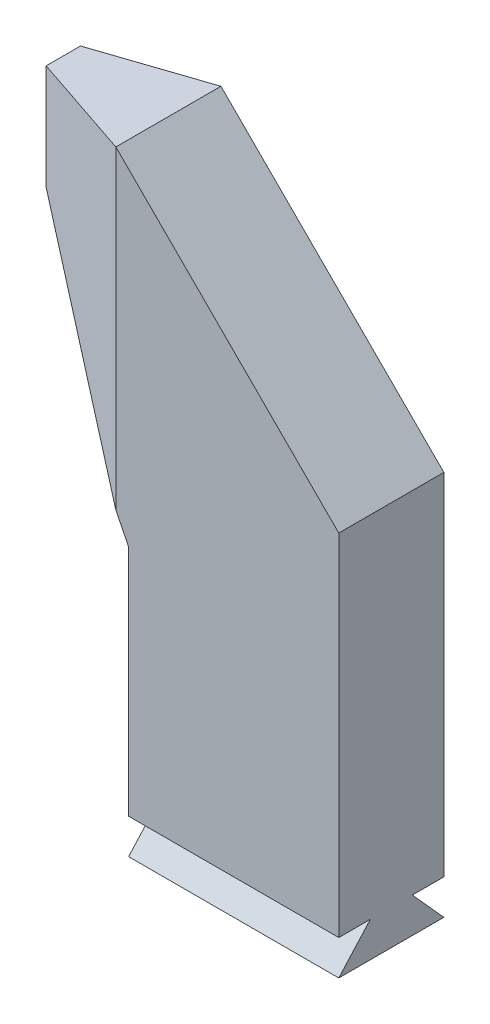
ISO-10303-21;
HEADER;
FILE_DESCRIPTION(('STEP AP214'),'2;1');
FILE_NAME('part.step','',(''),(''),'','','');
FILE_SCHEMA(('AUTOMOTIVE_DESIGN { 1 0 10303 214 1 1 1 1 }'));
ENDSEC;
DATA;
#1=APPLICATION_CONTEXT('core data for automotive mechanical design processes');
#2=APPLICATION_PROTOCOL_DEFINITION('international standard','automotive_design',2000,#1);
#3=PRODUCT_CONTEXT('',#1,'mechanical');
#4=PRODUCT('Part','Part','',(#3));
#5=PRODUCT_RELATED_PRODUCT_CATEGORY('part','',(#4));
#6=PRODUCT_DEFINITION_FORMATION('','',#4);
#7=PRODUCT_DEFINITION_CONTEXT('part definition',#1,'design');
#8=PRODUCT_DEFINITION('design','',#6,#7);
#9=PRODUCT_DEFINITION_SHAPE('','',#8);
#10=(LENGTH_UNIT() NAMED_UNIT(*) SI_UNIT(.MILLI.,.METRE.));
#11=(NAMED_UNIT(*) PLANE_ANGLE_UNIT() SI_UNIT($,.RADIAN.));
#12=(NAMED_UNIT(*) SI_UNIT($,.STERADIAN.) SOLID_ANGLE_UNIT());
#13=UNCERTAINTY_MEASURE_WITH_UNIT(LENGTH_MEASURE(1.E-05),#10,'distance_accuracy_value','');
#14=(GEOMETRIC_REPRESENTATION_CONTEXT(3) GLOBAL_UNCERTAINTY_ASSIGNED_CONTEXT((#13)) GLOBAL_UNIT_ASSIGNED_CONTEXT((#10,
#11,#12)) REPRESENTATION_CONTEXT('',''));
#15=CARTESIAN_POINT('',(0.,0.,0.));
#16=DIRECTION('',(0.,0.,1.));
#17=DIRECTION('',(1.,0.,0.));
#18=AXIS2_PLACEMENT_3D('',#15,#16,#17);
#19=CARTESIAN_POINT('',(-15.0771817725225,51.1255047640834,4.5));
#20=DIRECTION('',(0.,1.,0.));
#21=DIRECTION('',(-1.,0.,0.));
#22=AXIS2_PLACEMENT_3D('',#19,#20,#21);
#23=PLANE('',#22);
#24=DIRECTION('',(1.,0.,0.));
#25=VECTOR('',#24,1.);
#26=CARTESIAN_POINT('',(-24.5640147530276,51.1255047640834,-1.8));
#27=LINE('',#26,#25);
#28=CARTESIAN_POINT('',(-15.0771817725225,51.1255047640834,-1.8));
#29=VERTEX_POINT('',#28);
#30=CARTESIAN_POINT('',(2.92281822747751,51.1255047640834,-1.8));
#31=VERTEX_POINT('',#30);
#32=EDGE_CURVE('E67',#29,#31,#27,.T.);
#33=ORIENTED_EDGE('',*,*,#32,.F.);
#34=DIRECTION('',(0.,0.,-1.));
#35=VECTOR('',#34,1.);
#36=CARTESIAN_POINT('',(-15.0771817725225,51.1255047640834,4.5));
#37=LINE('',#36,#35);
#38=CARTESIAN_POINT('',(-15.0771817725225,51.1255047640834,-4.5));
#39=VERTEX_POINT('',#38);
#40=EDGE_CURVE('E208',#29,#39,#37,.T.);
#41=ORIENTED_EDGE('',*,*,#40,.T.);
#42=DIRECTION('',(1.,0.,0.));
#43=VECTOR('',#42,1.);
#44=CARTESIAN_POINT('',(-15.0771817725225,51.1255047640834,-4.5));
#45=LINE('',#44,#43);
#46=CARTESIAN_POINT('',(2.92281822747751,51.1255047640834,-4.5));
#47=VERTEX_POINT('',#46);
#48=EDGE_CURVE('E198',#39,#47,#45,.T.);
#49=ORIENTED_EDGE('',*,*,#48,.T.);
#50=DIRECTION('',(0.,0.,-1.));
#51=VECTOR('',#50,1.);
#52=CARTESIAN_POINT('',(2.92281822747751,51.1255047640834,4.5));
#53=LINE('',#52,#51);
#54=EDGE_CURVE('E173',#31,#47,#53,.T.);
#55=ORIENTED_EDGE('',*,*,#54,.F.);
#56=EDGE_LOOP('',(#33,#41,#49,#55));
#57=FACE_BOUND('',#56,.T.);
#58=ADVANCED_FACE('F44',(#57),#23,.F.);
#59=CARTESIAN_POINT('',(-15.0771817725225,51.1255047640834,4.5));
#60=VERTEX_POINT('',#59);
#61=CARTESIAN_POINT('',(-15.0771817725225,51.1255047640834,1.8));
#62=VERTEX_POINT('',#61);
#63=EDGE_CURVE('E206',#60,#62,#37,.T.);
#64=ORIENTED_EDGE('',*,*,#63,.T.);
#65=DIRECTION('',(1.,0.,0.));
#66=VECTOR('',#65,1.);
#67=CARTESIAN_POINT('',(-24.5640147530276,51.1255047640834,1.8));
#68=LINE('',#67,#66);
#69=CARTESIAN_POINT('',(2.92281822747751,51.1255047640834,1.8));
#70=VERTEX_POINT('',#69);
#71=EDGE_CURVE('E251',#62,#70,#68,.T.);
#72=ORIENTED_EDGE('',*,*,#71,.T.);
#73=CARTESIAN_POINT('',(2.92281822747751,51.1255047640834,4.5));
#74=VERTEX_POINT('',#73);
#75=EDGE_CURVE('E174',#74,#70,#53,.T.);
#76=ORIENTED_EDGE('',*,*,#75,.F.);
#77=DIRECTION('',(1.,0.,0.));
#78=VECTOR('',#77,1.);
#79=CARTESIAN_POINT('',(-15.0771817725225,51.1255047640834,4.5));
#80=LINE('',#79,#78);
#81=EDGE_CURVE('E205',#60,#74,#80,.T.);
#82=ORIENTED_EDGE('',*,*,#81,.F.);
#83=EDGE_LOOP('',(#64,#72,#76,#82));
#84=FACE_BOUND('',#83,.T.);
#85=ADVANCED_FACE('F46',(#84),#23,.F.);
#86=CARTESIAN_POINT('',(2.92281822747751,51.1255047640834,4.5));
#87=DIRECTION('',(-1.,0.,0.));
#88=DIRECTION('',(0.,-1.,0.));
#89=AXIS2_PLACEMENT_3D('',#86,#87,#88);
#90=PLANE('',#89);
#91=DIRECTION('',(0.,1.,0.));
#92=VECTOR('',#91,1.);
#93=CARTESIAN_POINT('',(2.92281822747751,51.1255047640834,-4.5));
#94=LINE('',#93,#92);
#95=CARTESIAN_POINT('',(2.92281822747751,81.1255047640834,-4.5));
#96=VERTEX_POINT('',#95);
#97=EDGE_CURVE('E192',#47,#96,#94,.T.);
#98=ORIENTED_EDGE('',*,*,#97,.T.);
#99=DIRECTION('',(0.,0.,-1.));
#100=VECTOR('',#99,1.);
#101=CARTESIAN_POINT('',(2.92281822747751,81.1255047640834,4.5));
#102=LINE('',#101,#100);
#103=CARTESIAN_POINT('',(2.92281822747751,81.1255047640834,4.5));
#104=VERTEX_POINT('',#103);
#105=EDGE_CURVE('E164',#104,#96,#102,.T.);
#106=ORIENTED_EDGE('',*,*,#105,.F.);
#107=DIRECTION('',(0.,1.,0.));
#108=VECTOR('',#107,1.);
#109=CARTESIAN_POINT('',(2.92281822747751,51.1255047640834,4.5));
#110=LINE('',#109,#108);
#111=EDGE_CURVE('E236',#74,#104,#110,.T.);
#112=ORIENTED_EDGE('',*,*,#111,.F.);
#113=ORIENTED_EDGE('',*,*,#75,.T.);
#114=DIRECTION('',(0.,-0.743294146247166,0.66896473162245));
#115=VECTOR('',#114,1.);
#116=CARTESIAN_POINT('',(2.92281822747751,51.1255047640834,1.8));
#117=LINE('',#116,#115);
#118=CARTESIAN_POINT('',(2.92281822747751,48.1255047640834,4.5));
#119=VERTEX_POINT('',#118);
#120=EDGE_CURVE('E262',#70,#119,#117,.T.);
#121=ORIENTED_EDGE('',*,*,#120,.T.);
#122=DIRECTION('',(0.,0.,-1.));
#123=VECTOR('',#122,1.);
#124=CARTESIAN_POINT('',(2.92281822747751,48.1255047640834,4.5));
#125=LINE('',#124,#123);
#126=CARTESIAN_POINT('',(2.92281822747751,48.1255047640834,-4.5));
#127=VERTEX_POINT('',#126);
#128=EDGE_CURVE('E258',#119,#127,#125,.T.);
#129=ORIENTED_EDGE('',*,*,#128,.T.);
#130=DIRECTION('',(0.,0.743294146247166,0.66896473162245));
#131=VECTOR('',#130,1.);
#132=CARTESIAN_POINT('',(2.92281822747751,48.1255047640834,-4.5));
#133=LINE('',#132,#131);
#134=EDGE_CURVE('E246',#127,#31,#133,.T.);
#135=ORIENTED_EDGE('',*,*,#134,.T.);
#136=ORIENTED_EDGE('',*,*,#54,.T.);
#137=EDGE_LOOP('',(#98,#106,#112,#113,#121,#129,#135,#136));
#138=FACE_BOUND('',#137,.T.);
#139=ADVANCED_FACE('F284',(#138),#90,.F.);
#140=CARTESIAN_POINT('',(2.92281822747751,81.1255047640834,4.5));
#141=DIRECTION('',(-0.707106781186542,-0.707106781186553,0.));
#142=DIRECTION('',(0.707106781186553,-0.707106781186542,0.));
#143=AXIS2_PLACEMENT_3D('',#140,#141,#142);
#144=PLANE('',#143);
#145=DIRECTION('',(-0.707106781186553,0.707106781186542,0.));
#146=VECTOR('',#145,1.);
#147=CARTESIAN_POINT('',(2.92281822747751,81.1255047640834,-4.5));
#148=LINE('',#147,#146);
#149=CARTESIAN_POINT('',(-16.1690648645594,100.21738785612,-4.5));
#150=VERTEX_POINT('',#149);
#151=EDGE_CURVE('E184',#96,#150,#148,.T.);
#152=ORIENTED_EDGE('',*,*,#151,.T.);
#153=DIRECTION('',(0.,0.,-1.));
#154=VECTOR('',#153,1.);
#155=CARTESIAN_POINT('',(-16.1690648645594,100.21738785612,4.5));
#156=LINE('',#155,#154);
#157=CARTESIAN_POINT('',(-16.1690648645594,100.21738785612,4.5));
#158=VERTEX_POINT('',#157);
#159=EDGE_CURVE('E152',#158,#150,#156,.T.);
#160=ORIENTED_EDGE('',*,*,#159,.F.);
#161=DIRECTION('',(-0.707106781186553,0.707106781186542,0.));
#162=VECTOR('',#161,1.);
#163=CARTESIAN_POINT('',(2.92281822747751,81.1255047640834,4.5));
#164=LINE('',#163,#162);
#165=EDGE_CURVE('E232',#104,#158,#164,.T.);
#166=ORIENTED_EDGE('',*,*,#165,.F.);
#167=ORIENTED_EDGE('',*,*,#105,.T.);
#168=EDGE_LOOP('',(#152,#160,#166,#167));
#169=FACE_BOUND('',#168,.T.);
#170=ADVANCED_FACE('F188',(#169),#144,.F.);
#171=CARTESIAN_POINT('',(-16.1690648645594,100.21738785612,4.5));
#172=DIRECTION('',(0.,-1.,0.));
#173=DIRECTION('',(1.,0.,0.));
#174=AXIS2_PLACEMENT_3D('',#171,#172,#173);
#175=PLANE('',#174);
#176=ORIENTED_EDGE('',*,*,#159,.T.);
#177=DIRECTION('',(0.94777508875968,0.,-0.318939463106373));
#178=VECTOR('',#177,1.);
#179=CARTESIAN_POINT('',(-25.1690648645593,100.21738785612,-1.47137516906696));
#180=LINE('',#179,#178);
#181=CARTESIAN_POINT('',(-25.1690648645593,100.21738785612,-1.47137516906696));
#182=VERTEX_POINT('',#181);
#183=EDGE_CURVE('E135',#182,#150,#180,.T.);
#184=ORIENTED_EDGE('',*,*,#183,.F.);
#185=DIRECTION('',(0.,0.,-1.));
#186=VECTOR('',#185,1.);
#187=CARTESIAN_POINT('',(-25.1690648645593,100.21738785612,4.5));
#188=LINE('',#187,#186);
#189=CARTESIAN_POINT('',(-25.1690648645593,100.21738785612,1.47137516906696));
#190=VERTEX_POINT('',#189);
#191=EDGE_CURVE('E150',#190,#182,#188,.T.);
#192=ORIENTED_EDGE('',*,*,#191,.F.);
#193=DIRECTION('',(-0.94777508875968,0.,-0.318939463106373));
#194=VECTOR('',#193,1.);
#195=CARTESIAN_POINT('',(-25.1690648645593,100.21738785612,1.47137516906696));
#196=LINE('',#195,#194);
#197=EDGE_CURVE('E154',#158,#190,#196,.T.);
#198=ORIENTED_EDGE('',*,*,#197,.F.);
#199=EDGE_LOOP('',(#176,#184,#192,#198));
#200=FACE_BOUND('',#199,.T.);
#201=ADVANCED_FACE('F148',(#200),#175,.F.);
#202=CARTESIAN_POINT('',(-25.1690648645593,100.21738785612,4.5));
#203=DIRECTION('',(1.,0.,0.));
#204=DIRECTION('',(0.,0.,-1.));
#205=AXIS2_PLACEMENT_3D('',#202,#203,#204);
#206=PLANE('',#205);
#207=ORIENTED_EDGE('',*,*,#191,.T.);
#208=DIRECTION('',(0.,1.,0.));
#209=VECTOR('',#208,1.);
#210=CARTESIAN_POINT('',(-25.1690648645594,48.1255047640834,-1.47137516906696));
#211=LINE('',#210,#209);
#212=CARTESIAN_POINT('',(-25.1690648645594,91.2173878561201,-1.47137516906696));
#213=VERTEX_POINT('',#212);
#214=EDGE_CURVE('E132',#213,#182,#211,.T.);
#215=ORIENTED_EDGE('',*,*,#214,.F.);
#216=DIRECTION('',(0.,0.,-1.));
#217=VECTOR('',#216,1.);
#218=CARTESIAN_POINT('',(-25.1690648645593,91.2173878561201,4.5));
#219=LINE('',#218,#217);
#220=CARTESIAN_POINT('',(-25.1690648645593,91.2173878561201,1.47137516906696));
#221=VERTEX_POINT('',#220);
#222=EDGE_CURVE('E160',#221,#213,#219,.T.);
#223=ORIENTED_EDGE('',*,*,#222,.F.);
#224=DIRECTION('',(0.,1.,0.));
#225=VECTOR('',#224,1.);
#226=CARTESIAN_POINT('',(-25.1690648645594,48.1255047640834,1.47137516906696));
#227=LINE('',#226,#225);
#228=EDGE_CURVE('E158',#221,#190,#227,.T.);
#229=ORIENTED_EDGE('',*,*,#228,.T.);
#230=EDGE_LOOP('',(#207,#215,#223,#229));
#231=FACE_BOUND('',#230,.T.);
#232=ADVANCED_FACE('F157',(#231),#206,.F.);
#233=CARTESIAN_POINT('',(-25.1690648645593,91.2173878561201,4.5));
#234=DIRECTION('',(0.893768711658158,0.44852813742386,0.));
#235=DIRECTION('',(-0.44852813742386,0.893768711658158,0.));
#236=AXIS2_PLACEMENT_3D('',#233,#234,#235);
#237=PLANE('',#236);
#238=ORIENTED_EDGE('',*,*,#222,.T.);
#239=DIRECTION('',(0.44350470069823,-0.883758658339874,-0.149245483241133));
#240=VECTOR('',#239,1.);
#241=CARTESIAN_POINT('',(-25.5643165965272,92.0049942553319,-1.33836747907727));
#242=LINE('',#241,#240);
#243=CARTESIAN_POINT('',(-16.1690648645595,73.2833548852481,-4.5));
#244=VERTEX_POINT('',#243);
#245=EDGE_CURVE('E138',#213,#244,#242,.T.);
#246=ORIENTED_EDGE('',*,*,#245,.T.);
#247=DIRECTION('',(0.44852813742386,-0.893768711658158,0.));
#248=VECTOR('',#247,1.);
#249=CARTESIAN_POINT('',(-25.1690648645593,91.2173878561201,-4.5));
#250=LINE('',#249,#248);
#251=CARTESIAN_POINT('',(-15.0771817725225,71.1075918438115,-4.5));
#252=VERTEX_POINT('',#251);
#253=EDGE_CURVE('E186',#244,#252,#250,.T.);
#254=ORIENTED_EDGE('',*,*,#253,.T.);
#255=DIRECTION('',(0.,0.,-1.));
#256=VECTOR('',#255,1.);
#257=CARTESIAN_POINT('',(-15.0771817725225,71.1075918438115,4.5));
#258=LINE('',#257,#256);
#259=CARTESIAN_POINT('',(-15.0771817725225,71.1075918438115,4.5));
#260=VERTEX_POINT('',#259);
#261=EDGE_CURVE('E166',#260,#252,#258,.T.);
#262=ORIENTED_EDGE('',*,*,#261,.F.);
#263=DIRECTION('',(0.44852813742386,-0.893768711658158,0.));
#264=VECTOR('',#263,1.);
#265=CARTESIAN_POINT('',(-25.1690648645593,91.2173878561201,4.5));
#266=LINE('',#265,#264);
#267=CARTESIAN_POINT('',(-16.1690648645595,73.2833548852481,4.5));
#268=VERTEX_POINT('',#267);
#269=EDGE_CURVE('E229',#268,#260,#266,.T.);
#270=ORIENTED_EDGE('',*,*,#269,.F.);
#271=DIRECTION('',(-0.44350470069823,0.883758658339874,-0.149245483241133));
#272=VECTOR('',#271,1.);
#273=CARTESIAN_POINT('',(-24.9685969361484,90.8179213630397,1.53883540748818));
#274=LINE('',#273,#272);
#275=EDGE_CURVE('E59',#268,#221,#274,.T.);
#276=ORIENTED_EDGE('',*,*,#275,.T.);
#277=EDGE_LOOP('',(#238,#246,#254,#262,#270,#276));
#278=FACE_BOUND('',#277,.T.);
#279=ADVANCED_FACE('F348',(#278),#237,.F.);
#280=CARTESIAN_POINT('',(-15.0771817725225,71.1075918438115,4.5));
#281=DIRECTION('',(1.,0.,0.));
#282=DIRECTION('',(0.,1.,0.));
#283=AXIS2_PLACEMENT_3D('',#280,#281,#282);
#284=PLANE('',#283);
#285=DIRECTION('',(0.,-1.,0.));
#286=VECTOR('',#285,1.);
#287=CARTESIAN_POINT('',(-15.0771817725225,71.1075918438115,-4.5));
#288=LINE('',#287,#286);
#289=EDGE_CURVE('E196',#252,#39,#288,.T.);
#290=ORIENTED_EDGE('',*,*,#289,.T.);
#291=ORIENTED_EDGE('',*,*,#40,.F.);
#292=DIRECTION('',(0.,-0.743294146247166,-0.66896473162245));
#293=VECTOR('',#292,1.);
#294=CARTESIAN_POINT('',(-15.0771817725225,48.1255047640834,-4.5));
#295=LINE('',#294,#293);
#296=CARTESIAN_POINT('',(-15.0771817725225,48.1255047640834,-4.5));
#297=VERTEX_POINT('',#296);
#298=EDGE_CURVE('E254',#29,#297,#295,.T.);
#299=ORIENTED_EDGE('',*,*,#298,.T.);
#300=DIRECTION('',(0.,0.,1.));
#301=VECTOR('',#300,1.);
#302=CARTESIAN_POINT('',(-15.0771817725225,48.1255047640834,4.5));
#303=LINE('',#302,#301);
#304=CARTESIAN_POINT('',(-15.0771817725225,48.1255047640834,4.5));
#305=VERTEX_POINT('',#304);
#306=EDGE_CURVE('E222',#297,#305,#303,.T.);
#307=ORIENTED_EDGE('',*,*,#306,.T.);
#308=DIRECTION('',(0.,0.743294146247166,-0.66896473162245));
#309=VECTOR('',#308,1.);
#310=CARTESIAN_POINT('',(-15.0771817725225,51.1255047640834,1.8));
#311=LINE('',#310,#309);
#312=EDGE_CURVE('E224',#305,#62,#311,.T.);
#313=ORIENTED_EDGE('',*,*,#312,.T.);
#314=ORIENTED_EDGE('',*,*,#63,.F.);
#315=DIRECTION('',(0.,-1.,0.));
#316=VECTOR('',#315,1.);
#317=CARTESIAN_POINT('',(-15.0771817725225,71.1075918438115,4.5));
#318=LINE('',#317,#316);
#319=EDGE_CURVE('E217',#260,#60,#318,.T.);
#320=ORIENTED_EDGE('',*,*,#319,.F.);
#321=ORIENTED_EDGE('',*,*,#261,.T.);
#322=EDGE_LOOP('',(#290,#291,#299,#307,#313,#314,#320,#321));
#323=FACE_BOUND('',#322,.T.);
#324=ADVANCED_FACE('F214',(#323),#284,.F.);
#325=CARTESIAN_POINT('',(-6.07718177252249,51.1255047640834,4.5));
#326=DIRECTION('',(0.,0.,1.));
#327=DIRECTION('',(1.,0.,0.));
#328=AXIS2_PLACEMENT_3D('',#325,#326,#327);
#329=PLANE('',#328);
#330=DIRECTION('',(0.,1.,0.));
#331=VECTOR('',#330,1.);
#332=CARTESIAN_POINT('',(-16.1690648645595,51.1255047640834,4.5));
#333=LINE('',#332,#331);
#334=EDGE_CURVE('E11',#268,#158,#333,.T.);
#335=ORIENTED_EDGE('',*,*,#334,.F.);
#336=ORIENTED_EDGE('',*,*,#269,.T.);
#337=ORIENTED_EDGE('',*,*,#319,.T.);
#338=ORIENTED_EDGE('',*,*,#81,.T.);
#339=ORIENTED_EDGE('',*,*,#111,.T.);
#340=ORIENTED_EDGE('',*,*,#165,.T.);
#341=EDGE_LOOP('',(#335,#336,#337,#338,#339,#340));
#342=FACE_BOUND('',#341,.T.);
#343=ADVANCED_FACE('F280',(#342),#329,.T.);
#344=CARTESIAN_POINT('',(-6.07718177252249,51.1255047640834,-4.5));
#345=DIRECTION('',(0.,0.,1.));
#346=DIRECTION('',(1.,0.,0.));
#347=AXIS2_PLACEMENT_3D('',#344,#345,#346);
#348=PLANE('',#347);
#349=ORIENTED_EDGE('',*,*,#253,.F.);
#350=DIRECTION('',(0.,1.,0.));
#351=VECTOR('',#350,1.);
#352=CARTESIAN_POINT('',(-16.1690648645595,51.1255047640834,-4.5));
#353=LINE('',#352,#351);
#354=EDGE_CURVE('E53',#244,#150,#353,.T.);
#355=ORIENTED_EDGE('',*,*,#354,.T.);
#356=ORIENTED_EDGE('',*,*,#151,.F.);
#357=ORIENTED_EDGE('',*,*,#97,.F.);
#358=ORIENTED_EDGE('',*,*,#48,.F.);
#359=ORIENTED_EDGE('',*,*,#289,.F.);
#360=EDGE_LOOP('',(#349,#355,#356,#357,#358,#359));
#361=FACE_BOUND('',#360,.T.);
#362=ADVANCED_FACE('F182',(#361),#348,.F.);
#363=CARTESIAN_POINT('',(-24.5640147530276,51.1255047640834,1.8));
#364=DIRECTION('',(0.,0.66896473162245,0.743294146247166));
#365=DIRECTION('',(0.,-0.743294146247166,0.66896473162245));
#366=AXIS2_PLACEMENT_3D('',#363,#364,#365);
#367=PLANE('',#366);
#368=ORIENTED_EDGE('',*,*,#312,.F.);
#369=DIRECTION('',(1.,0.,0.));
#370=VECTOR('',#369,1.);
#371=CARTESIAN_POINT('',(-24.5640147530276,48.1255047640834,4.5));
#372=LINE('',#371,#370);
#373=EDGE_CURVE('E242',#305,#119,#372,.T.);
#374=ORIENTED_EDGE('',*,*,#373,.T.);
#375=ORIENTED_EDGE('',*,*,#120,.F.);
#376=ORIENTED_EDGE('',*,*,#71,.F.);
#377=EDGE_LOOP('',(#368,#374,#375,#376));
#378=FACE_BOUND('',#377,.T.);
#379=ADVANCED_FACE('F298',(#378),#367,.T.);
#380=CARTESIAN_POINT('',(-24.5640147530276,48.1255047640834,-4.5));
#381=DIRECTION('',(0.,0.66896473162245,-0.743294146247166));
#382=DIRECTION('',(0.,0.743294146247166,0.66896473162245));
#383=AXIS2_PLACEMENT_3D('',#380,#381,#382);
#384=PLANE('',#383);
#385=ORIENTED_EDGE('',*,*,#298,.F.);
#386=ORIENTED_EDGE('',*,*,#32,.T.);
#387=ORIENTED_EDGE('',*,*,#134,.F.);
#388=DIRECTION('',(1.,0.,0.));
#389=VECTOR('',#388,1.);
#390=CARTESIAN_POINT('',(-24.5640147530276,48.1255047640834,-4.5));
#391=LINE('',#390,#389);
#392=EDGE_CURVE('E245',#297,#127,#391,.T.);
#393=ORIENTED_EDGE('',*,*,#392,.F.);
#394=EDGE_LOOP('',(#385,#386,#387,#393));
#395=FACE_BOUND('',#394,.T.);
#396=ADVANCED_FACE('F289',(#395),#384,.T.);
#397=CARTESIAN_POINT('',(-24.5640147530276,48.1255047640834,4.5));
#398=DIRECTION('',(0.,-1.,0.));
#399=DIRECTION('',(1.,0.,0.));
#400=AXIS2_PLACEMENT_3D('',#397,#398,#399);
#401=PLANE('',#400);
#402=ORIENTED_EDGE('',*,*,#306,.F.);
#403=ORIENTED_EDGE('',*,*,#392,.T.);
#404=ORIENTED_EDGE('',*,*,#128,.F.);
#405=ORIENTED_EDGE('',*,*,#373,.F.);
#406=EDGE_LOOP('',(#402,#403,#404,#405));
#407=FACE_BOUND('',#406,.T.);
#408=ADVANCED_FACE('F301',(#407),#401,.T.);
#409=CARTESIAN_POINT('',(-25.1690648645594,48.1255047640834,-1.47137516906696));
#410=DIRECTION('',(0.318939463106373,0.,0.94777508875968));
#411=DIRECTION('',(0.94777508875968,0.,-0.318939463106373));
#412=AXIS2_PLACEMENT_3D('',#409,#410,#411);
#413=PLANE('',#412);
#414=ORIENTED_EDGE('',*,*,#214,.T.);
#415=ORIENTED_EDGE('',*,*,#183,.T.);
#416=ORIENTED_EDGE('',*,*,#354,.F.);
#417=ORIENTED_EDGE('',*,*,#245,.F.);
#418=EDGE_LOOP('',(#414,#415,#416,#417));
#419=FACE_BOUND('',#418,.T.);
#420=ADVANCED_FACE('F134',(#419),#413,.F.);
#421=CARTESIAN_POINT('',(-25.1690648645594,48.1255047640834,1.47137516906696));
#422=DIRECTION('',(0.318939463106373,0.,-0.94777508875968));
#423=DIRECTION('',(-0.94777508875968,0.,-0.318939463106373));
#424=AXIS2_PLACEMENT_3D('',#421,#422,#423);
#425=PLANE('',#424);
#426=ORIENTED_EDGE('',*,*,#334,.T.);
#427=ORIENTED_EDGE('',*,*,#197,.T.);
#428=ORIENTED_EDGE('',*,*,#228,.F.);
#429=ORIENTED_EDGE('',*,*,#275,.F.);
#430=EDGE_LOOP('',(#426,#427,#428,#429));
#431=FACE_BOUND('',#430,.T.);
#432=ADVANCED_FACE('F278',(#431),#425,.F.);
#433=CLOSED_SHELL('',(#58,#85,#139,#170,#201,#232,#279,#324,#343,#362,#379,#396,#408,#420,#432));
#434=MANIFOLD_SOLID_BREP('B2',#433);
#435=ADVANCED_BREP_SHAPE_REPRESENTATION('',(#18,#434),#14);
#436=SHAPE_DEFINITION_REPRESENTATION(#9,#435);
ENDSEC;
END-ISO-10303-21;
